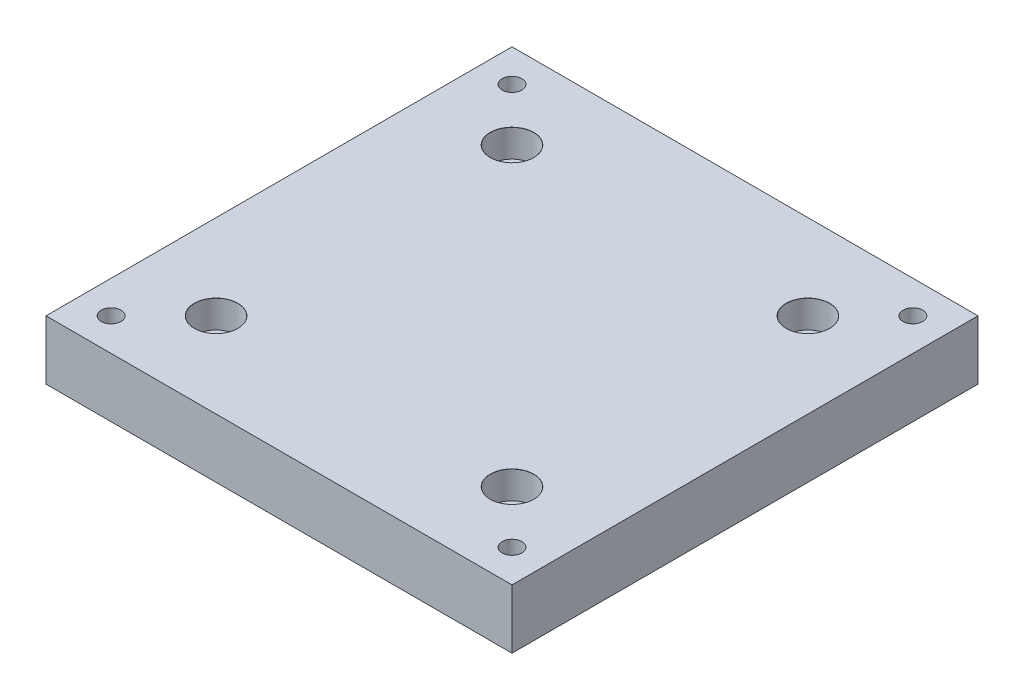
ISO-10303-21;
HEADER;
FILE_DESCRIPTION(('STEP AP214'),'2;1');
FILE_NAME('part.step','',(''),(''),'','','');
FILE_SCHEMA(('AUTOMOTIVE_DESIGN { 1 0 10303 214 1 1 1 1 }'));
ENDSEC;
DATA;
#1=APPLICATION_CONTEXT('core data for automotive mechanical design processes');
#2=APPLICATION_PROTOCOL_DEFINITION('international standard','automotive_design',2000,#1);
#3=PRODUCT_CONTEXT('',#1,'mechanical');
#4=PRODUCT('Part','Part','',(#3));
#5=PRODUCT_RELATED_PRODUCT_CATEGORY('part','',(#4));
#6=PRODUCT_DEFINITION_FORMATION('','',#4);
#7=PRODUCT_DEFINITION_CONTEXT('part definition',#1,'design');
#8=PRODUCT_DEFINITION('design','',#6,#7);
#9=PRODUCT_DEFINITION_SHAPE('','',#8);
#10=(LENGTH_UNIT() NAMED_UNIT(*) SI_UNIT(.MILLI.,.METRE.));
#11=(NAMED_UNIT(*) PLANE_ANGLE_UNIT() SI_UNIT($,.RADIAN.));
#12=(NAMED_UNIT(*) SI_UNIT($,.STERADIAN.) SOLID_ANGLE_UNIT());
#13=UNCERTAINTY_MEASURE_WITH_UNIT(LENGTH_MEASURE(1.E-05),#10,'distance_accuracy_value','');
#14=(GEOMETRIC_REPRESENTATION_CONTEXT(3) GLOBAL_UNCERTAINTY_ASSIGNED_CONTEXT((#13)) GLOBAL_UNIT_ASSIGNED_CONTEXT((#10,
#11,#12)) REPRESENTATION_CONTEXT('',''));
#15=CARTESIAN_POINT('',(0.,0.,0.));
#16=DIRECTION('',(0.,0.,1.));
#17=DIRECTION('',(1.,0.,0.));
#18=AXIS2_PLACEMENT_3D('',#15,#16,#17);
#19=CARTESIAN_POINT('',(-59.055,-15.,-59.055));
#20=DIRECTION('',(0.,0.,1.));
#21=DIRECTION('',(1.,0.,0.));
#22=AXIS2_PLACEMENT_3D('',#19,#20,#21);
#23=PLANE('',#22);
#24=DIRECTION('',(1.,0.,0.));
#25=VECTOR('',#24,1.);
#26=CARTESIAN_POINT('',(-59.055,0.,-59.055));
#27=LINE('',#26,#25);
#28=CARTESIAN_POINT('',(-59.055,0.,-59.055));
#29=VERTEX_POINT('',#28);
#30=CARTESIAN_POINT('',(59.055,0.,-59.055));
#31=VERTEX_POINT('',#30);
#32=EDGE_CURVE('E185',#29,#31,#27,.T.);
#33=ORIENTED_EDGE('',*,*,#32,.T.);
#34=DIRECTION('',(0.,1.,0.));
#35=VECTOR('',#34,1.);
#36=CARTESIAN_POINT('',(59.055,-15.,-59.055));
#37=LINE('',#36,#35);
#38=CARTESIAN_POINT('',(59.055,-15.,-59.055));
#39=VERTEX_POINT('',#38);
#40=EDGE_CURVE('E12',#39,#31,#37,.T.);
#41=ORIENTED_EDGE('',*,*,#40,.F.);
#42=DIRECTION('',(1.,0.,0.));
#43=VECTOR('',#42,1.);
#44=CARTESIAN_POINT('',(-59.055,-15.,-59.055));
#45=LINE('',#44,#43);
#46=CARTESIAN_POINT('',(-59.055,-15.,-59.055));
#47=VERTEX_POINT('',#46);
#48=EDGE_CURVE('E77',#47,#39,#45,.T.);
#49=ORIENTED_EDGE('',*,*,#48,.F.);
#50=DIRECTION('',(0.,1.,0.));
#51=VECTOR('',#50,1.);
#52=CARTESIAN_POINT('',(-59.055,-15.,-59.055));
#53=LINE('',#52,#51);
#54=EDGE_CURVE('E194',#47,#29,#53,.T.);
#55=ORIENTED_EDGE('',*,*,#54,.T.);
#56=EDGE_LOOP('',(#33,#41,#49,#55));
#57=FACE_BOUND('',#56,.T.);
#58=ADVANCED_FACE('F37',(#57),#23,.F.);
#59=CARTESIAN_POINT('',(59.055,-15.,59.055));
#60=DIRECTION('',(1.,0.,0.));
#61=DIRECTION('',(0.,0.,-1.));
#62=AXIS2_PLACEMENT_3D('',#59,#60,#61);
#63=PLANE('',#62);
#64=DIRECTION('',(0.,0.,-1.));
#65=VECTOR('',#64,1.);
#66=CARTESIAN_POINT('',(59.055,0.,59.055));
#67=LINE('',#66,#65);
#68=CARTESIAN_POINT('',(59.055,0.,59.055));
#69=VERTEX_POINT('',#68);
#70=EDGE_CURVE('E197',#69,#31,#67,.T.);
#71=ORIENTED_EDGE('',*,*,#70,.F.);
#72=DIRECTION('',(0.,1.,0.));
#73=VECTOR('',#72,1.);
#74=CARTESIAN_POINT('',(59.055,-15.,59.055));
#75=LINE('',#74,#73);
#76=CARTESIAN_POINT('',(59.055,-15.,59.055));
#77=VERTEX_POINT('',#76);
#78=EDGE_CURVE('E45',#77,#69,#75,.T.);
#79=ORIENTED_EDGE('',*,*,#78,.F.);
#80=DIRECTION('',(0.,0.,-1.));
#81=VECTOR('',#80,1.);
#82=CARTESIAN_POINT('',(59.055,-15.,59.055));
#83=LINE('',#82,#81);
#84=EDGE_CURVE('E187',#77,#39,#83,.T.);
#85=ORIENTED_EDGE('',*,*,#84,.T.);
#86=ORIENTED_EDGE('',*,*,#40,.T.);
#87=EDGE_LOOP('',(#71,#79,#85,#86));
#88=FACE_BOUND('',#87,.T.);
#89=ADVANCED_FACE('F210',(#88),#63,.T.);
#90=CARTESIAN_POINT('',(-59.055,-15.,59.055));
#91=DIRECTION('',(0.,0.,1.));
#92=DIRECTION('',(1.,0.,0.));
#93=AXIS2_PLACEMENT_3D('',#90,#91,#92);
#94=PLANE('',#93);
#95=DIRECTION('',(1.,0.,0.));
#96=VECTOR('',#95,1.);
#97=CARTESIAN_POINT('',(-59.055,0.,59.055));
#98=LINE('',#97,#96);
#99=CARTESIAN_POINT('',(-59.055,0.,59.055));
#100=VERTEX_POINT('',#99);
#101=EDGE_CURVE('E200',#100,#69,#98,.T.);
#102=ORIENTED_EDGE('',*,*,#101,.F.);
#103=DIRECTION('',(0.,1.,0.));
#104=VECTOR('',#103,1.);
#105=CARTESIAN_POINT('',(-59.055,-15.,59.055));
#106=LINE('',#105,#104);
#107=CARTESIAN_POINT('',(-59.055,-15.,59.055));
#108=VERTEX_POINT('',#107);
#109=EDGE_CURVE('E69',#108,#100,#106,.T.);
#110=ORIENTED_EDGE('',*,*,#109,.F.);
#111=DIRECTION('',(1.,0.,0.));
#112=VECTOR('',#111,1.);
#113=CARTESIAN_POINT('',(-59.055,-15.,59.055));
#114=LINE('',#113,#112);
#115=EDGE_CURVE('E190',#108,#77,#114,.T.);
#116=ORIENTED_EDGE('',*,*,#115,.T.);
#117=ORIENTED_EDGE('',*,*,#78,.T.);
#118=EDGE_LOOP('',(#102,#110,#116,#117));
#119=FACE_BOUND('',#118,.T.);
#120=ADVANCED_FACE('F208',(#119),#94,.T.);
#121=CARTESIAN_POINT('',(-59.055,-15.,59.055));
#122=DIRECTION('',(1.,0.,0.));
#123=DIRECTION('',(0.,0.,-1.));
#124=AXIS2_PLACEMENT_3D('',#121,#122,#123);
#125=PLANE('',#124);
#126=DIRECTION('',(0.,0.,-1.));
#127=VECTOR('',#126,1.);
#128=CARTESIAN_POINT('',(-59.055,0.,59.055));
#129=LINE('',#128,#127);
#130=EDGE_CURVE('E72',#100,#29,#129,.T.);
#131=ORIENTED_EDGE('',*,*,#130,.T.);
#132=ORIENTED_EDGE('',*,*,#54,.F.);
#133=DIRECTION('',(0.,0.,-1.));
#134=VECTOR('',#133,1.);
#135=CARTESIAN_POINT('',(-59.055,-15.,59.055));
#136=LINE('',#135,#134);
#137=EDGE_CURVE('E53',#108,#47,#136,.T.);
#138=ORIENTED_EDGE('',*,*,#137,.F.);
#139=ORIENTED_EDGE('',*,*,#109,.T.);
#140=EDGE_LOOP('',(#131,#132,#138,#139));
#141=FACE_BOUND('',#140,.T.);
#142=ADVANCED_FACE('F215',(#141),#125,.F.);
#143=CARTESIAN_POINT('',(0.,-15.,0.));
#144=DIRECTION('',(0.,1.,0.));
#145=DIRECTION('',(0.,0.,1.));
#146=AXIS2_PLACEMENT_3D('',#143,#144,#145);
#147=PLANE('',#146);
#148=CARTESIAN_POINT('',(-37.5,-15.,37.5));
#149=DIRECTION('',(0.,1.,0.));
#150=DIRECTION('',(0.,0.,1.));
#151=AXIS2_PLACEMENT_3D('',#148,#149,#150);
#152=CIRCLE('',#151,3.3);
#153=CARTESIAN_POINT('',(-37.5,-15.,40.8));
#154=VERTEX_POINT('',#153);
#155=EDGE_CURVE('E137',#154,#154,#152,.T.);
#156=ORIENTED_EDGE('',*,*,#155,.T.);
#157=EDGE_LOOP('',(#156));
#158=FACE_BOUND('',#157,.T.);
#159=CARTESIAN_POINT('',(37.5,-15.,37.5));
#160=DIRECTION('',(0.,1.,0.));
#161=DIRECTION('',(0.,0.,1.));
#162=AXIS2_PLACEMENT_3D('',#159,#160,#161);
#163=CIRCLE('',#162,3.3);
#164=CARTESIAN_POINT('',(37.5,-15.,40.8));
#165=VERTEX_POINT('',#164);
#166=EDGE_CURVE('E152',#165,#165,#163,.T.);
#167=ORIENTED_EDGE('',*,*,#166,.T.);
#168=EDGE_LOOP('',(#167));
#169=FACE_BOUND('',#168,.T.);
#170=CARTESIAN_POINT('',(37.5,-15.,-37.5));
#171=DIRECTION('',(0.,1.,0.));
#172=DIRECTION('',(0.,0.,1.));
#173=AXIS2_PLACEMENT_3D('',#170,#171,#172);
#174=CIRCLE('',#173,3.3);
#175=CARTESIAN_POINT('',(37.5,-15.,-34.2));
#176=VERTEX_POINT('',#175);
#177=EDGE_CURVE('E167',#176,#176,#174,.T.);
#178=ORIENTED_EDGE('',*,*,#177,.T.);
#179=EDGE_LOOP('',(#178));
#180=FACE_BOUND('',#179,.T.);
#181=CARTESIAN_POINT('',(-37.5,-15.,-37.5));
#182=DIRECTION('',(0.,1.,0.));
#183=DIRECTION('',(0.,0.,1.));
#184=AXIS2_PLACEMENT_3D('',#181,#182,#183);
#185=CIRCLE('',#184,3.3);
#186=CARTESIAN_POINT('',(-37.5,-15.,-34.2));
#187=VERTEX_POINT('',#186);
#188=EDGE_CURVE('E182',#187,#187,#185,.T.);
#189=ORIENTED_EDGE('',*,*,#188,.T.);
#190=EDGE_LOOP('',(#189));
#191=FACE_BOUND('',#190,.T.);
#192=ORIENTED_EDGE('',*,*,#48,.T.);
#193=ORIENTED_EDGE('',*,*,#84,.F.);
#194=ORIENTED_EDGE('',*,*,#115,.F.);
#195=ORIENTED_EDGE('',*,*,#137,.T.);
#196=EDGE_LOOP('',(#192,#193,#194,#195));
#197=FACE_BOUND('',#196,.T.);
#198=ADVANCED_FACE('F216',(#158,#169,#180,#191,#197),#147,.F.);
#199=CARTESIAN_POINT('',(0.,0.,0.));
#200=DIRECTION('',(0.,1.,0.));
#201=DIRECTION('',(0.,0.,1.));
#202=AXIS2_PLACEMENT_3D('',#199,#200,#201);
#203=PLANE('',#202);
#204=CARTESIAN_POINT('',(-50.8,0.,50.8));
#205=DIRECTION('',(0.,1.,0.));
#206=DIRECTION('',(0.,0.,1.));
#207=AXIS2_PLACEMENT_3D('',#204,#205,#206);
#208=CIRCLE('',#207,2.49999999999999);
#209=CARTESIAN_POINT('',(-50.8,0.,53.3));
#210=VERTEX_POINT('',#209);
#211=EDGE_CURVE('E103',#210,#210,#208,.T.);
#212=ORIENTED_EDGE('',*,*,#211,.F.);
#213=EDGE_LOOP('',(#212));
#214=FACE_BOUND('',#213,.T.);
#215=CARTESIAN_POINT('',(-50.8,0.,-50.8));
#216=DIRECTION('',(0.,1.,0.));
#217=DIRECTION('',(0.,0.,1.));
#218=AXIS2_PLACEMENT_3D('',#215,#216,#217);
#219=CIRCLE('',#218,2.49999999999999);
#220=CARTESIAN_POINT('',(-50.8,0.,-48.3));
#221=VERTEX_POINT('',#220);
#222=EDGE_CURVE('E102',#221,#221,#219,.T.);
#223=ORIENTED_EDGE('',*,*,#222,.F.);
#224=EDGE_LOOP('',(#223));
#225=FACE_BOUND('',#224,.T.);
#226=CARTESIAN_POINT('',(50.8,0.,-50.8));
#227=DIRECTION('',(0.,1.,0.));
#228=DIRECTION('',(0.,0.,1.));
#229=AXIS2_PLACEMENT_3D('',#226,#227,#228);
#230=CIRCLE('',#229,2.49999999999999);
#231=CARTESIAN_POINT('',(50.8,0.,-48.3));
#232=VERTEX_POINT('',#231);
#233=EDGE_CURVE('E113',#232,#232,#230,.T.);
#234=ORIENTED_EDGE('',*,*,#233,.F.);
#235=EDGE_LOOP('',(#234));
#236=FACE_BOUND('',#235,.T.);
#237=CARTESIAN_POINT('',(50.8,0.,50.8));
#238=DIRECTION('',(0.,1.,0.));
#239=DIRECTION('',(0.,0.,1.));
#240=AXIS2_PLACEMENT_3D('',#237,#238,#239);
#241=CIRCLE('',#240,2.49999999999999);
#242=CARTESIAN_POINT('',(50.8,0.,53.3));
#243=VERTEX_POINT('',#242);
#244=EDGE_CURVE('E119',#243,#243,#241,.T.);
#245=ORIENTED_EDGE('',*,*,#244,.F.);
#246=EDGE_LOOP('',(#245));
#247=FACE_BOUND('',#246,.T.);
#248=CARTESIAN_POINT('',(-37.5,0.,37.5));
#249=DIRECTION('',(0.,1.,0.));
#250=DIRECTION('',(0.,0.,1.));
#251=AXIS2_PLACEMENT_3D('',#248,#249,#250);
#252=CIRCLE('',#251,5.525);
#253=CARTESIAN_POINT('',(-37.5,0.,43.025));
#254=VERTEX_POINT('',#253);
#255=EDGE_CURVE('E125',#254,#254,#252,.T.);
#256=ORIENTED_EDGE('',*,*,#255,.F.);
#257=EDGE_LOOP('',(#256));
#258=FACE_BOUND('',#257,.T.);
#259=CARTESIAN_POINT('',(37.5,0.,37.5));
#260=DIRECTION('',(0.,1.,0.));
#261=DIRECTION('',(0.,0.,1.));
#262=AXIS2_PLACEMENT_3D('',#259,#260,#261);
#263=CIRCLE('',#262,5.525);
#264=CARTESIAN_POINT('',(37.5,0.,43.025));
#265=VERTEX_POINT('',#264);
#266=EDGE_CURVE('E140',#265,#265,#263,.T.);
#267=ORIENTED_EDGE('',*,*,#266,.F.);
#268=EDGE_LOOP('',(#267));
#269=FACE_BOUND('',#268,.T.);
#270=CARTESIAN_POINT('',(37.5,0.,-37.5));
#271=DIRECTION('',(0.,1.,0.));
#272=DIRECTION('',(0.,0.,1.));
#273=AXIS2_PLACEMENT_3D('',#270,#271,#272);
#274=CIRCLE('',#273,5.525);
#275=CARTESIAN_POINT('',(37.5,0.,-31.975));
#276=VERTEX_POINT('',#275);
#277=EDGE_CURVE('E155',#276,#276,#274,.T.);
#278=ORIENTED_EDGE('',*,*,#277,.F.);
#279=EDGE_LOOP('',(#278));
#280=FACE_BOUND('',#279,.T.);
#281=CARTESIAN_POINT('',(-37.5,0.,-37.5));
#282=DIRECTION('',(0.,1.,0.));
#283=DIRECTION('',(0.,0.,1.));
#284=AXIS2_PLACEMENT_3D('',#281,#282,#283);
#285=CIRCLE('',#284,5.525);
#286=CARTESIAN_POINT('',(-37.5,0.,-31.975));
#287=VERTEX_POINT('',#286);
#288=EDGE_CURVE('E170',#287,#287,#285,.T.);
#289=ORIENTED_EDGE('',*,*,#288,.F.);
#290=EDGE_LOOP('',(#289));
#291=FACE_BOUND('',#290,.T.);
#292=ORIENTED_EDGE('',*,*,#32,.F.);
#293=ORIENTED_EDGE('',*,*,#130,.F.);
#294=ORIENTED_EDGE('',*,*,#101,.T.);
#295=ORIENTED_EDGE('',*,*,#70,.T.);
#296=EDGE_LOOP('',(#292,#293,#294,#295));
#297=FACE_BOUND('',#296,.T.);
#298=ADVANCED_FACE('F213',(#214,#225,#236,#247,#258,#269,#280,#291,#297),#203,.T.);
#299=CARTESIAN_POINT('',(-37.5,0.,-37.5));
#300=DIRECTION('',(0.,1.,0.));
#301=DIRECTION('',(0.,0.,1.));
#302=AXIS2_PLACEMENT_3D('',#299,#300,#301);
#303=CYLINDRICAL_SURFACE('',#302,3.3);
#304=ORIENTED_EDGE('',*,*,#188,.F.);
#305=EDGE_LOOP('',(#304));
#306=FACE_BOUND('',#305,.T.);
#307=CARTESIAN_POINT('',(-37.5,-7.,-37.5));
#308=DIRECTION('',(0.,1.,0.));
#309=DIRECTION('',(0.,0.,1.));
#310=AXIS2_PLACEMENT_3D('',#307,#308,#309);
#311=CIRCLE('',#310,3.3);
#312=CARTESIAN_POINT('',(-37.5,-7.,-34.2));
#313=VERTEX_POINT('',#312);
#314=EDGE_CURVE('E179',#313,#313,#311,.T.);
#315=ORIENTED_EDGE('',*,*,#314,.T.);
#316=EDGE_LOOP('',(#315));
#317=FACE_BOUND('',#316,.T.);
#318=ADVANCED_FACE('F224',(#306,#317),#303,.F.);
#319=CARTESIAN_POINT('',(-34.2,-7.,-37.5));
#320=DIRECTION('',(0.,-1.,0.));
#321=DIRECTION('',(0.,0.,-1.));
#322=AXIS2_PLACEMENT_3D('',#319,#320,#321);
#323=PLANE('',#322);
#324=ORIENTED_EDGE('',*,*,#314,.F.);
#325=EDGE_LOOP('',(#324));
#326=FACE_BOUND('',#325,.T.);
#327=CARTESIAN_POINT('',(-37.5,-7.,-37.5));
#328=DIRECTION('',(0.,1.,0.));
#329=DIRECTION('',(0.,0.,1.));
#330=AXIS2_PLACEMENT_3D('',#327,#328,#329);
#331=CIRCLE('',#330,5.5);
#332=CARTESIAN_POINT('',(-37.5,-7.,-32.));
#333=VERTEX_POINT('',#332);
#334=EDGE_CURVE('E176',#333,#333,#331,.T.);
#335=ORIENTED_EDGE('',*,*,#334,.T.);
#336=EDGE_LOOP('',(#335));
#337=FACE_BOUND('',#336,.T.);
#338=ADVANCED_FACE('F258',(#326,#337),#323,.F.);
#339=CARTESIAN_POINT('',(-37.5,0.,-37.5));
#340=DIRECTION('',(0.,1.,0.));
#341=DIRECTION('',(0.,0.,1.));
#342=AXIS2_PLACEMENT_3D('',#339,#340,#341);
#343=CYLINDRICAL_SURFACE('',#342,5.5);
#344=ORIENTED_EDGE('',*,*,#334,.F.);
#345=EDGE_LOOP('',(#344));
#346=FACE_BOUND('',#345,.T.);
#347=CARTESIAN_POINT('',(-37.5,-0.0250000000000017,-37.5));
#348=DIRECTION('',(0.,1.,0.));
#349=DIRECTION('',(0.,0.,1.));
#350=AXIS2_PLACEMENT_3D('',#347,#348,#349);
#351=CIRCLE('',#350,5.5);
#352=CARTESIAN_POINT('',(-37.5,-0.0250000000000017,-32.));
#353=VERTEX_POINT('',#352);
#354=EDGE_CURVE('E173',#353,#353,#351,.T.);
#355=ORIENTED_EDGE('',*,*,#354,.T.);
#356=EDGE_LOOP('',(#355));
#357=FACE_BOUND('',#356,.T.);
#358=ADVANCED_FACE('F267',(#346,#357),#343,.F.);
#359=CARTESIAN_POINT('',(-37.5,0.,-37.5));
#360=DIRECTION('',(0.,1.,0.));
#361=DIRECTION('',(0.,0.,1.));
#362=AXIS2_PLACEMENT_3D('',#359,#360,#361);
#363=CONICAL_SURFACE('',#362,5.525,0.785398163397498);
#364=ORIENTED_EDGE('',*,*,#354,.F.);
#365=EDGE_LOOP('',(#364));
#366=FACE_BOUND('',#365,.T.);
#367=ORIENTED_EDGE('',*,*,#288,.T.);
#368=EDGE_LOOP('',(#367));
#369=FACE_BOUND('',#368,.T.);
#370=ADVANCED_FACE('F277',(#366,#369),#363,.F.);
#371=CARTESIAN_POINT('',(37.5,0.,-37.5));
#372=DIRECTION('',(0.,1.,0.));
#373=DIRECTION('',(0.,0.,1.));
#374=AXIS2_PLACEMENT_3D('',#371,#372,#373);
#375=CYLINDRICAL_SURFACE('',#374,3.3);
#376=ORIENTED_EDGE('',*,*,#177,.F.);
#377=EDGE_LOOP('',(#376));
#378=FACE_BOUND('',#377,.T.);
#379=CARTESIAN_POINT('',(37.5,-7.,-37.5));
#380=DIRECTION('',(0.,1.,0.));
#381=DIRECTION('',(0.,0.,1.));
#382=AXIS2_PLACEMENT_3D('',#379,#380,#381);
#383=CIRCLE('',#382,3.3);
#384=CARTESIAN_POINT('',(37.5,-7.,-34.2));
#385=VERTEX_POINT('',#384);
#386=EDGE_CURVE('E164',#385,#385,#383,.T.);
#387=ORIENTED_EDGE('',*,*,#386,.T.);
#388=EDGE_LOOP('',(#387));
#389=FACE_BOUND('',#388,.T.);
#390=ADVANCED_FACE('F287',(#378,#389),#375,.F.);
#391=CARTESIAN_POINT('',(40.8,-7.,-37.5));
#392=DIRECTION('',(0.,-1.,0.));
#393=DIRECTION('',(0.,0.,-1.));
#394=AXIS2_PLACEMENT_3D('',#391,#392,#393);
#395=PLANE('',#394);
#396=ORIENTED_EDGE('',*,*,#386,.F.);
#397=EDGE_LOOP('',(#396));
#398=FACE_BOUND('',#397,.T.);
#399=CARTESIAN_POINT('',(37.5,-7.,-37.5));
#400=DIRECTION('',(0.,1.,0.));
#401=DIRECTION('',(0.,0.,1.));
#402=AXIS2_PLACEMENT_3D('',#399,#400,#401);
#403=CIRCLE('',#402,5.5);
#404=CARTESIAN_POINT('',(37.5,-7.,-32.));
#405=VERTEX_POINT('',#404);
#406=EDGE_CURVE('E161',#405,#405,#403,.T.);
#407=ORIENTED_EDGE('',*,*,#406,.T.);
#408=EDGE_LOOP('',(#407));
#409=FACE_BOUND('',#408,.T.);
#410=ADVANCED_FACE('F297',(#398,#409),#395,.F.);
#411=CARTESIAN_POINT('',(37.5,0.,-37.5));
#412=DIRECTION('',(0.,1.,0.));
#413=DIRECTION('',(0.,0.,1.));
#414=AXIS2_PLACEMENT_3D('',#411,#412,#413);
#415=CYLINDRICAL_SURFACE('',#414,5.5);
#416=ORIENTED_EDGE('',*,*,#406,.F.);
#417=EDGE_LOOP('',(#416));
#418=FACE_BOUND('',#417,.T.);
#419=CARTESIAN_POINT('',(37.5,-0.0250000000000017,-37.5));
#420=DIRECTION('',(0.,1.,0.));
#421=DIRECTION('',(0.,0.,1.));
#422=AXIS2_PLACEMENT_3D('',#419,#420,#421);
#423=CIRCLE('',#422,5.5);
#424=CARTESIAN_POINT('',(37.5,-0.0250000000000017,-32.));
#425=VERTEX_POINT('',#424);
#426=EDGE_CURVE('E158',#425,#425,#423,.T.);
#427=ORIENTED_EDGE('',*,*,#426,.T.);
#428=EDGE_LOOP('',(#427));
#429=FACE_BOUND('',#428,.T.);
#430=ADVANCED_FACE('F307',(#418,#429),#415,.F.);
#431=CARTESIAN_POINT('',(37.5,0.,-37.5));
#432=DIRECTION('',(0.,1.,0.));
#433=DIRECTION('',(0.,0.,1.));
#434=AXIS2_PLACEMENT_3D('',#431,#432,#433);
#435=CONICAL_SURFACE('',#434,5.525,0.785398163397498);
#436=ORIENTED_EDGE('',*,*,#426,.F.);
#437=EDGE_LOOP('',(#436));
#438=FACE_BOUND('',#437,.T.);
#439=ORIENTED_EDGE('',*,*,#277,.T.);
#440=EDGE_LOOP('',(#439));
#441=FACE_BOUND('',#440,.T.);
#442=ADVANCED_FACE('F317',(#438,#441),#435,.F.);
#443=CARTESIAN_POINT('',(37.5,0.,37.5));
#444=DIRECTION('',(0.,1.,0.));
#445=DIRECTION('',(0.,0.,1.));
#446=AXIS2_PLACEMENT_3D('',#443,#444,#445);
#447=CYLINDRICAL_SURFACE('',#446,3.3);
#448=ORIENTED_EDGE('',*,*,#166,.F.);
#449=EDGE_LOOP('',(#448));
#450=FACE_BOUND('',#449,.T.);
#451=CARTESIAN_POINT('',(37.5,-7.,37.5));
#452=DIRECTION('',(0.,1.,0.));
#453=DIRECTION('',(0.,0.,1.));
#454=AXIS2_PLACEMENT_3D('',#451,#452,#453);
#455=CIRCLE('',#454,3.3);
#456=CARTESIAN_POINT('',(37.5,-7.,40.8));
#457=VERTEX_POINT('',#456);
#458=EDGE_CURVE('E149',#457,#457,#455,.T.);
#459=ORIENTED_EDGE('',*,*,#458,.T.);
#460=EDGE_LOOP('',(#459));
#461=FACE_BOUND('',#460,.T.);
#462=ADVANCED_FACE('F327',(#450,#461),#447,.F.);
#463=CARTESIAN_POINT('',(40.8,-7.,37.5));
#464=DIRECTION('',(0.,-1.,0.));
#465=DIRECTION('',(0.,0.,-1.));
#466=AXIS2_PLACEMENT_3D('',#463,#464,#465);
#467=PLANE('',#466);
#468=ORIENTED_EDGE('',*,*,#458,.F.);
#469=EDGE_LOOP('',(#468));
#470=FACE_BOUND('',#469,.T.);
#471=CARTESIAN_POINT('',(37.5,-7.,37.5));
#472=DIRECTION('',(0.,1.,0.));
#473=DIRECTION('',(0.,0.,1.));
#474=AXIS2_PLACEMENT_3D('',#471,#472,#473);
#475=CIRCLE('',#474,5.5);
#476=CARTESIAN_POINT('',(37.5,-7.,43.));
#477=VERTEX_POINT('',#476);
#478=EDGE_CURVE('E146',#477,#477,#475,.T.);
#479=ORIENTED_EDGE('',*,*,#478,.T.);
#480=EDGE_LOOP('',(#479));
#481=FACE_BOUND('',#480,.T.);
#482=ADVANCED_FACE('F337',(#470,#481),#467,.F.);
#483=CARTESIAN_POINT('',(37.5,0.,37.5));
#484=DIRECTION('',(0.,1.,0.));
#485=DIRECTION('',(0.,0.,1.));
#486=AXIS2_PLACEMENT_3D('',#483,#484,#485);
#487=CYLINDRICAL_SURFACE('',#486,5.5);
#488=ORIENTED_EDGE('',*,*,#478,.F.);
#489=EDGE_LOOP('',(#488));
#490=FACE_BOUND('',#489,.T.);
#491=CARTESIAN_POINT('',(37.5,-0.0250000000000017,37.5));
#492=DIRECTION('',(0.,1.,0.));
#493=DIRECTION('',(0.,0.,1.));
#494=AXIS2_PLACEMENT_3D('',#491,#492,#493);
#495=CIRCLE('',#494,5.5);
#496=CARTESIAN_POINT('',(37.5,-0.0250000000000017,43.));
#497=VERTEX_POINT('',#496);
#498=EDGE_CURVE('E143',#497,#497,#495,.T.);
#499=ORIENTED_EDGE('',*,*,#498,.T.);
#500=EDGE_LOOP('',(#499));
#501=FACE_BOUND('',#500,.T.);
#502=ADVANCED_FACE('F347',(#490,#501),#487,.F.);
#503=CARTESIAN_POINT('',(37.5,0.,37.5));
#504=DIRECTION('',(0.,1.,0.));
#505=DIRECTION('',(0.,0.,1.));
#506=AXIS2_PLACEMENT_3D('',#503,#504,#505);
#507=CONICAL_SURFACE('',#506,5.525,0.785398163397498);
#508=ORIENTED_EDGE('',*,*,#498,.F.);
#509=EDGE_LOOP('',(#508));
#510=FACE_BOUND('',#509,.T.);
#511=ORIENTED_EDGE('',*,*,#266,.T.);
#512=EDGE_LOOP('',(#511));
#513=FACE_BOUND('',#512,.T.);
#514=ADVANCED_FACE('F357',(#510,#513),#507,.F.);
#515=CARTESIAN_POINT('',(-37.5,0.,37.5));
#516=DIRECTION('',(0.,1.,0.));
#517=DIRECTION('',(0.,0.,1.));
#518=AXIS2_PLACEMENT_3D('',#515,#516,#517);
#519=CYLINDRICAL_SURFACE('',#518,3.3);
#520=ORIENTED_EDGE('',*,*,#155,.F.);
#521=EDGE_LOOP('',(#520));
#522=FACE_BOUND('',#521,.T.);
#523=CARTESIAN_POINT('',(-37.5,-7.,37.5));
#524=DIRECTION('',(0.,1.,0.));
#525=DIRECTION('',(0.,0.,1.));
#526=AXIS2_PLACEMENT_3D('',#523,#524,#525);
#527=CIRCLE('',#526,3.3);
#528=CARTESIAN_POINT('',(-37.5,-7.,40.8));
#529=VERTEX_POINT('',#528);
#530=EDGE_CURVE('E134',#529,#529,#527,.T.);
#531=ORIENTED_EDGE('',*,*,#530,.T.);
#532=EDGE_LOOP('',(#531));
#533=FACE_BOUND('',#532,.T.);
#534=ADVANCED_FACE('F367',(#522,#533),#519,.F.);
#535=CARTESIAN_POINT('',(-34.2,-7.,37.5));
#536=DIRECTION('',(0.,-1.,0.));
#537=DIRECTION('',(0.,0.,-1.));
#538=AXIS2_PLACEMENT_3D('',#535,#536,#537);
#539=PLANE('',#538);
#540=ORIENTED_EDGE('',*,*,#530,.F.);
#541=EDGE_LOOP('',(#540));
#542=FACE_BOUND('',#541,.T.);
#543=CARTESIAN_POINT('',(-37.5,-7.,37.5));
#544=DIRECTION('',(0.,1.,0.));
#545=DIRECTION('',(0.,0.,1.));
#546=AXIS2_PLACEMENT_3D('',#543,#544,#545);
#547=CIRCLE('',#546,5.5);
#548=CARTESIAN_POINT('',(-37.5,-7.,43.));
#549=VERTEX_POINT('',#548);
#550=EDGE_CURVE('E131',#549,#549,#547,.T.);
#551=ORIENTED_EDGE('',*,*,#550,.T.);
#552=EDGE_LOOP('',(#551));
#553=FACE_BOUND('',#552,.T.);
#554=ADVANCED_FACE('F377',(#542,#553),#539,.F.);
#555=CARTESIAN_POINT('',(-37.5,0.,37.5));
#556=DIRECTION('',(0.,1.,0.));
#557=DIRECTION('',(0.,0.,1.));
#558=AXIS2_PLACEMENT_3D('',#555,#556,#557);
#559=CYLINDRICAL_SURFACE('',#558,5.5);
#560=ORIENTED_EDGE('',*,*,#550,.F.);
#561=EDGE_LOOP('',(#560));
#562=FACE_BOUND('',#561,.T.);
#563=CARTESIAN_POINT('',(-37.5,-0.0250000000000017,37.5));
#564=DIRECTION('',(0.,1.,0.));
#565=DIRECTION('',(0.,0.,1.));
#566=AXIS2_PLACEMENT_3D('',#563,#564,#565);
#567=CIRCLE('',#566,5.5);
#568=CARTESIAN_POINT('',(-37.5,-0.0250000000000017,43.));
#569=VERTEX_POINT('',#568);
#570=EDGE_CURVE('E128',#569,#569,#567,.T.);
#571=ORIENTED_EDGE('',*,*,#570,.T.);
#572=EDGE_LOOP('',(#571));
#573=FACE_BOUND('',#572,.T.);
#574=ADVANCED_FACE('F387',(#562,#573),#559,.F.);
#575=CARTESIAN_POINT('',(-37.5,0.,37.5));
#576=DIRECTION('',(0.,1.,0.));
#577=DIRECTION('',(0.,0.,1.));
#578=AXIS2_PLACEMENT_3D('',#575,#576,#577);
#579=CONICAL_SURFACE('',#578,5.525,0.785398163397498);
#580=ORIENTED_EDGE('',*,*,#570,.F.);
#581=EDGE_LOOP('',(#580));
#582=FACE_BOUND('',#581,.T.);
#583=ORIENTED_EDGE('',*,*,#255,.T.);
#584=EDGE_LOOP('',(#583));
#585=FACE_BOUND('',#584,.T.);
#586=ADVANCED_FACE('F397',(#582,#585),#579,.F.);
#587=CARTESIAN_POINT('',(50.8,-10.,50.8));
#588=DIRECTION('',(0.,1.,0.));
#589=DIRECTION('',(0.,0.,1.));
#590=AXIS2_PLACEMENT_3D('',#587,#588,#589);
#591=CONICAL_SURFACE('',#590,2.5,1.02974425867665);
#592=CARTESIAN_POINT('',(50.8,-11.5021515475689,50.8));
#593=VERTEX_POINT('',#592);
#594=VERTEX_LOOP('',#593);
#595=FACE_BOUND('',#594,.T.);
#596=CARTESIAN_POINT('',(50.8,-10.,50.8));
#597=DIRECTION('',(0.,1.,0.));
#598=DIRECTION('',(0.,0.,1.));
#599=AXIS2_PLACEMENT_3D('',#596,#597,#598);
#600=CIRCLE('',#599,2.5);
#601=CARTESIAN_POINT('',(50.8,-10.,53.3));
#602=VERTEX_POINT('',#601);
#603=EDGE_CURVE('E122',#602,#602,#600,.T.);
#604=ORIENTED_EDGE('',*,*,#603,.T.);
#605=EDGE_LOOP('',(#604));
#606=FACE_BOUND('',#605,.T.);
#607=ADVANCED_FACE('F407',(#595,#606),#591,.F.);
#608=CARTESIAN_POINT('',(50.8,0.,50.8));
#609=DIRECTION('',(0.,1.,0.));
#610=DIRECTION('',(0.,0.,1.));
#611=AXIS2_PLACEMENT_3D('',#608,#609,#610);
#612=CYLINDRICAL_SURFACE('',#611,2.49999999999999);
#613=ORIENTED_EDGE('',*,*,#603,.F.);
#614=EDGE_LOOP('',(#613));
#615=FACE_BOUND('',#614,.T.);
#616=ORIENTED_EDGE('',*,*,#244,.T.);
#617=EDGE_LOOP('',(#616));
#618=FACE_BOUND('',#617,.T.);
#619=ADVANCED_FACE('F422',(#615,#618),#612,.F.);
#620=CARTESIAN_POINT('',(50.8,-10.,-50.8));
#621=DIRECTION('',(0.,1.,0.));
#622=DIRECTION('',(0.,0.,1.));
#623=AXIS2_PLACEMENT_3D('',#620,#621,#622);
#624=CONICAL_SURFACE('',#623,2.5,1.02974425867665);
#625=CARTESIAN_POINT('',(50.8,-11.5021515475689,-50.8));
#626=VERTEX_POINT('',#625);
#627=VERTEX_LOOP('',#626);
#628=FACE_BOUND('',#627,.T.);
#629=CARTESIAN_POINT('',(50.8,-10.,-50.8));
#630=DIRECTION('',(0.,1.,0.));
#631=DIRECTION('',(0.,0.,1.));
#632=AXIS2_PLACEMENT_3D('',#629,#630,#631);
#633=CIRCLE('',#632,2.5);
#634=CARTESIAN_POINT('',(50.8,-10.,-48.3));
#635=VERTEX_POINT('',#634);
#636=EDGE_CURVE('E116',#635,#635,#633,.T.);
#637=ORIENTED_EDGE('',*,*,#636,.T.);
#638=EDGE_LOOP('',(#637));
#639=FACE_BOUND('',#638,.T.);
#640=ADVANCED_FACE('F433',(#628,#639),#624,.F.);
#641=CARTESIAN_POINT('',(50.8,0.,-50.8));
#642=DIRECTION('',(0.,1.,0.));
#643=DIRECTION('',(0.,0.,1.));
#644=AXIS2_PLACEMENT_3D('',#641,#642,#643);
#645=CYLINDRICAL_SURFACE('',#644,2.49999999999999);
#646=ORIENTED_EDGE('',*,*,#636,.F.);
#647=EDGE_LOOP('',(#646));
#648=FACE_BOUND('',#647,.T.);
#649=ORIENTED_EDGE('',*,*,#233,.T.);
#650=EDGE_LOOP('',(#649));
#651=FACE_BOUND('',#650,.T.);
#652=ADVANCED_FACE('F445',(#648,#651),#645,.F.);
#653=CARTESIAN_POINT('',(-50.8,-10.,-50.8));
#654=DIRECTION('',(0.,1.,0.));
#655=DIRECTION('',(0.,0.,1.));
#656=AXIS2_PLACEMENT_3D('',#653,#654,#655);
#657=CONICAL_SURFACE('',#656,2.5,1.02974425867665);
#658=CARTESIAN_POINT('',(-50.8,-11.5021515475689,-50.8));
#659=VERTEX_POINT('',#658);
#660=VERTEX_LOOP('',#659);
#661=FACE_BOUND('',#660,.T.);
#662=CARTESIAN_POINT('',(-50.8,-10.,-50.8));
#663=DIRECTION('',(0.,1.,0.));
#664=DIRECTION('',(0.,0.,1.));
#665=AXIS2_PLACEMENT_3D('',#662,#663,#664);
#666=CIRCLE('',#665,2.5);
#667=CARTESIAN_POINT('',(-50.8,-10.,-48.3));
#668=VERTEX_POINT('',#667);
#669=EDGE_CURVE('E106',#668,#668,#666,.T.);
#670=ORIENTED_EDGE('',*,*,#669,.T.);
#671=EDGE_LOOP('',(#670));
#672=FACE_BOUND('',#671,.T.);
#673=ADVANCED_FACE('F455',(#661,#672),#657,.F.);
#674=CARTESIAN_POINT('',(-50.8,0.,-50.8));
#675=DIRECTION('',(0.,1.,0.));
#676=DIRECTION('',(0.,0.,1.));
#677=AXIS2_PLACEMENT_3D('',#674,#675,#676);
#678=CYLINDRICAL_SURFACE('',#677,2.49999999999999);
#679=ORIENTED_EDGE('',*,*,#669,.F.);
#680=EDGE_LOOP('',(#679));
#681=FACE_BOUND('',#680,.T.);
#682=ORIENTED_EDGE('',*,*,#222,.T.);
#683=EDGE_LOOP('',(#682));
#684=FACE_BOUND('',#683,.T.);
#685=ADVANCED_FACE('F96',(#681,#684),#678,.F.);
#686=CARTESIAN_POINT('',(-50.8,-10.,50.8));
#687=DIRECTION('',(0.,1.,0.));
#688=DIRECTION('',(0.,0.,1.));
#689=AXIS2_PLACEMENT_3D('',#686,#687,#688);
#690=CONICAL_SURFACE('',#689,2.5,1.02974425867665);
#691=CARTESIAN_POINT('',(-50.8,-11.5021515475689,50.8));
#692=VERTEX_POINT('',#691);
#693=VERTEX_LOOP('',#692);
#694=FACE_BOUND('',#693,.T.);
#695=CARTESIAN_POINT('',(-50.8,-10.,50.8));
#696=DIRECTION('',(0.,1.,0.));
#697=DIRECTION('',(0.,0.,1.));
#698=AXIS2_PLACEMENT_3D('',#695,#696,#697);
#699=CIRCLE('',#698,2.5);
#700=CARTESIAN_POINT('',(-50.8,-10.,53.3));
#701=VERTEX_POINT('',#700);
#702=EDGE_CURVE('E100',#701,#701,#699,.T.);
#703=ORIENTED_EDGE('',*,*,#702,.T.);
#704=EDGE_LOOP('',(#703));
#705=FACE_BOUND('',#704,.T.);
#706=ADVANCED_FACE('F92',(#694,#705),#690,.F.);
#707=CARTESIAN_POINT('',(-50.8,0.,50.8));
#708=DIRECTION('',(0.,1.,0.));
#709=DIRECTION('',(0.,0.,1.));
#710=AXIS2_PLACEMENT_3D('',#707,#708,#709);
#711=CYLINDRICAL_SURFACE('',#710,2.49999999999999);
#712=ORIENTED_EDGE('',*,*,#702,.F.);
#713=EDGE_LOOP('',(#712));
#714=FACE_BOUND('',#713,.T.);
#715=ORIENTED_EDGE('',*,*,#211,.T.);
#716=EDGE_LOOP('',(#715));
#717=FACE_BOUND('',#716,.T.);
#718=ADVANCED_FACE('F95',(#714,#717),#711,.F.);
#719=CLOSED_SHELL('',(#58,#89,#120,#142,#198,#298,#318,#338,#358,#370,#390,#410,#430,#442,#462,
#482,#502,#514,#534,#554,#574,#586,#607,#619,#640,#652,#673,#685,#706,#718));
#720=MANIFOLD_SOLID_BREP('B2',#719);
#721=ADVANCED_BREP_SHAPE_REPRESENTATION('',(#18,#720),#14);
#722=SHAPE_DEFINITION_REPRESENTATION(#9,#721);
ENDSEC;
END-ISO-10303-21;
